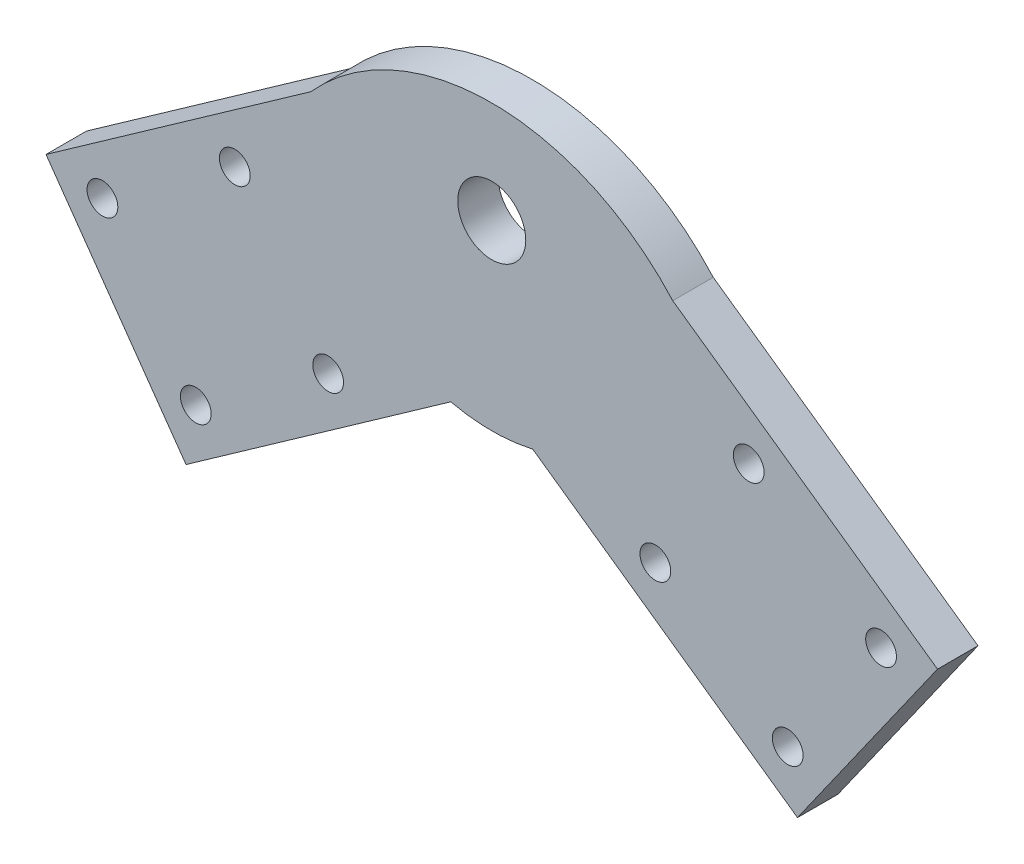
ISO-10303-21;
HEADER;
FILE_DESCRIPTION(('STEP AP214'),'2;1');
FILE_NAME('part.step','',(''),(''),'','','');
FILE_SCHEMA(('AUTOMOTIVE_DESIGN { 1 0 10303 214 1 1 1 1 }'));
ENDSEC;
DATA;
#1=APPLICATION_CONTEXT('core data for automotive mechanical design processes');
#2=APPLICATION_PROTOCOL_DEFINITION('international standard','automotive_design',2000,#1);
#3=PRODUCT_CONTEXT('',#1,'mechanical');
#4=PRODUCT('Part','Part','',(#3));
#5=PRODUCT_RELATED_PRODUCT_CATEGORY('part','',(#4));
#6=PRODUCT_DEFINITION_FORMATION('','',#4);
#7=PRODUCT_DEFINITION_CONTEXT('part definition',#1,'design');
#8=PRODUCT_DEFINITION('design','',#6,#7);
#9=PRODUCT_DEFINITION_SHAPE('','',#8);
#10=(LENGTH_UNIT() NAMED_UNIT(*) SI_UNIT(.MILLI.,.METRE.));
#11=(NAMED_UNIT(*) PLANE_ANGLE_UNIT() SI_UNIT($,.RADIAN.));
#12=(NAMED_UNIT(*) SI_UNIT($,.STERADIAN.) SOLID_ANGLE_UNIT());
#13=UNCERTAINTY_MEASURE_WITH_UNIT(LENGTH_MEASURE(1.E-05),#10,'distance_accuracy_value','');
#14=(GEOMETRIC_REPRESENTATION_CONTEXT(3) GLOBAL_UNCERTAINTY_ASSIGNED_CONTEXT((#13)) GLOBAL_UNIT_ASSIGNED_CONTEXT((#10,
#11,#12)) REPRESENTATION_CONTEXT('',''));
#15=CARTESIAN_POINT('',(0.,0.,0.));
#16=DIRECTION('',(0.,0.,1.));
#17=DIRECTION('',(1.,0.,0.));
#18=AXIS2_PLACEMENT_3D('',#15,#16,#17);
#19=CARTESIAN_POINT('',(0.,-17.4178512732149,5.));
#20=DIRECTION('',(0.,0.,-1.));
#21=DIRECTION('',(-1.,0.,0.));
#22=AXIS2_PLACEMENT_3D('',#19,#20,#21);
#23=CYLINDRICAL_SURFACE('',#22,30.);
#24=CARTESIAN_POINT('',(0.,-17.4178512732149,0.));
#25=DIRECTION('',(0.,0.,1.));
#26=DIRECTION('',(1.,0.,0.));
#27=AXIS2_PLACEMENT_3D('',#24,#25,#26);
#28=CIRCLE('',#27,30.);
#29=CARTESIAN_POINT('',(-22.3499546368663,2.59413332926824,0.));
#30=VERTEX_POINT('',#29);
#31=CARTESIAN_POINT('',(22.3499546368663,2.59413332926824,0.));
#32=VERTEX_POINT('',#31);
#33=EDGE_CURVE('E144',#30,#32,#28,.F.);
#34=ORIENTED_EDGE('',*,*,#33,.F.);
#35=DIRECTION('',(0.,0.,-1.));
#36=VECTOR('',#35,1.);
#37=CARTESIAN_POINT('',(-22.3499546368663,2.59413332926824,5.));
#38=LINE('',#37,#36);
#39=CARTESIAN_POINT('',(-22.3499546368663,2.59413332926824,5.));
#40=VERTEX_POINT('',#39);
#41=EDGE_CURVE('E11',#40,#30,#38,.T.);
#42=ORIENTED_EDGE('',*,*,#41,.F.);
#43=CARTESIAN_POINT('',(0.,-17.4178512732149,5.));
#44=DIRECTION('',(0.,0.,1.));
#45=DIRECTION('',(1.,0.,0.));
#46=AXIS2_PLACEMENT_3D('',#43,#44,#45);
#47=CIRCLE('',#46,30.);
#48=CARTESIAN_POINT('',(22.3499546368663,2.59413332926824,5.));
#49=VERTEX_POINT('',#48);
#50=EDGE_CURVE('E167',#40,#49,#47,.F.);
#51=ORIENTED_EDGE('',*,*,#50,.T.);
#52=DIRECTION('',(0.,0.,-1.));
#53=VECTOR('',#52,1.);
#54=CARTESIAN_POINT('',(22.3499546368663,2.59413332926824,5.));
#55=LINE('',#54,#53);
#56=EDGE_CURVE('E61',#49,#32,#55,.T.);
#57=ORIENTED_EDGE('',*,*,#56,.T.);
#58=EDGE_LOOP('',(#34,#42,#51,#57));
#59=FACE_BOUND('',#58,.T.);
#60=ADVANCED_FACE('F45',(#59),#23,.T.);
#61=CARTESIAN_POINT('',(-8.64427795706465,12.258729893468,5.));
#62=DIRECTION('',(0.576285197137643,-0.817248659564534,0.));
#63=DIRECTION('',(0.817248659564534,0.576285197137643,0.));
#64=AXIS2_PLACEMENT_3D('',#61,#62,#63);
#65=PLANE('',#64);
#66=DIRECTION('',(-0.817248659564534,-0.576285197137643,0.));
#67=VECTOR('',#66,1.);
#68=CARTESIAN_POINT('',(-8.64427795706465,12.258729893468,0.));
#69=LINE('',#68,#67);
#70=CARTESIAN_POINT('',(-55.0399010194476,-20.4572745562375,0.));
#71=VERTEX_POINT('',#70);
#72=EDGE_CURVE('E146',#30,#71,#69,.T.);
#73=ORIENTED_EDGE('',*,*,#72,.T.);
#74=DIRECTION('',(0.,0.,-1.));
#75=VECTOR('',#74,1.);
#76=CARTESIAN_POINT('',(-55.0399010194476,-20.4572745562375,5.));
#77=LINE('',#76,#75);
#78=CARTESIAN_POINT('',(-55.0399010194476,-20.4572745562375,5.));
#79=VERTEX_POINT('',#78);
#80=EDGE_CURVE('E53',#79,#71,#77,.T.);
#81=ORIENTED_EDGE('',*,*,#80,.F.);
#82=DIRECTION('',(-0.817248659564534,-0.576285197137643,0.));
#83=VECTOR('',#82,1.);
#84=CARTESIAN_POINT('',(-8.64427795706465,12.258729893468,5.));
#85=LINE('',#84,#83);
#86=EDGE_CURVE('E193',#40,#79,#85,.T.);
#87=ORIENTED_EDGE('',*,*,#86,.F.);
#88=ORIENTED_EDGE('',*,*,#41,.T.);
#89=EDGE_LOOP('',(#73,#81,#87,#88));
#90=FACE_BOUND('',#89,.T.);
#91=ADVANCED_FACE('F183',(#90),#65,.F.);
#92=CARTESIAN_POINT('',(-46.395623062383,-32.7160044497055,5.));
#93=DIRECTION('',(-0.817248659564534,-0.576285197137643,0.));
#94=DIRECTION('',(0.576285197137643,-0.817248659564534,0.));
#95=AXIS2_PLACEMENT_3D('',#92,#93,#94);
#96=PLANE('',#95);
#97=DIRECTION('',(-0.576285197137643,0.817248659564534,0.));
#98=VECTOR('',#97,1.);
#99=CARTESIAN_POINT('',(-46.395623062383,-32.7160044497055,0.));
#100=LINE('',#99,#98);
#101=CARTESIAN_POINT('',(-37.7513451053183,-44.9747343431735,0.));
#102=VERTEX_POINT('',#101);
#103=EDGE_CURVE('E150',#102,#71,#100,.T.);
#104=ORIENTED_EDGE('',*,*,#103,.F.);
#105=DIRECTION('',(0.,0.,-1.));
#106=VECTOR('',#105,1.);
#107=CARTESIAN_POINT('',(-37.7513451053183,-44.9747343431735,5.));
#108=LINE('',#107,#106);
#109=CARTESIAN_POINT('',(-37.7513451053183,-44.9747343431735,5.));
#110=VERTEX_POINT('',#109);
#111=EDGE_CURVE('E173',#110,#102,#108,.T.);
#112=ORIENTED_EDGE('',*,*,#111,.F.);
#113=DIRECTION('',(-0.576285197137643,0.817248659564534,0.));
#114=VECTOR('',#113,1.);
#115=CARTESIAN_POINT('',(-46.395623062383,-32.7160044497055,5.));
#116=LINE('',#115,#114);
#117=EDGE_CURVE('E180',#110,#79,#116,.T.);
#118=ORIENTED_EDGE('',*,*,#117,.T.);
#119=ORIENTED_EDGE('',*,*,#80,.T.);
#120=EDGE_LOOP('',(#104,#112,#118,#119));
#121=FACE_BOUND('',#120,.T.);
#122=ADVANCED_FACE('F178',(#121),#96,.T.);
#123=CARTESIAN_POINT('',(8.64427795706465,-12.258729893468,5.));
#124=DIRECTION('',(0.576285197137643,-0.817248659564534,0.));
#125=DIRECTION('',(0.817248659564534,0.576285197137643,0.));
#126=AXIS2_PLACEMENT_3D('',#123,#124,#125);
#127=PLANE('',#126);
#128=DIRECTION('',(-0.817248659564534,-0.576285197137643,0.));
#129=VECTOR('',#128,1.);
#130=CARTESIAN_POINT('',(8.64427795706465,-12.258729893468,0.));
#131=LINE('',#130,#129);
#132=CARTESIAN_POINT('',(-5.06139872273697,-21.9233264576678,0.));
#133=VERTEX_POINT('',#132);
#134=EDGE_CURVE('E153',#133,#102,#131,.T.);
#135=ORIENTED_EDGE('',*,*,#134,.F.);
#136=DIRECTION('',(0.,0.,-1.));
#137=VECTOR('',#136,1.);
#138=CARTESIAN_POINT('',(-5.06139872273697,-21.9233264576678,5.));
#139=LINE('',#138,#137);
#140=CARTESIAN_POINT('',(-5.06139872273697,-21.9233264576678,5.));
#141=VERTEX_POINT('',#140);
#142=EDGE_CURVE('E171',#141,#133,#139,.T.);
#143=ORIENTED_EDGE('',*,*,#142,.F.);
#144=DIRECTION('',(-0.817248659564534,-0.576285197137643,0.));
#145=VECTOR('',#144,1.);
#146=CARTESIAN_POINT('',(8.64427795706465,-12.258729893468,5.));
#147=LINE('',#146,#145);
#148=EDGE_CURVE('E192',#141,#110,#147,.T.);
#149=ORIENTED_EDGE('',*,*,#148,.T.);
#150=ORIENTED_EDGE('',*,*,#111,.T.);
#151=EDGE_LOOP('',(#135,#143,#149,#150));
#152=FACE_BOUND('',#151,.T.);
#153=ADVANCED_FACE('F190',(#152),#127,.T.);
#154=CARTESIAN_POINT('',(0.,0.,5.));
#155=DIRECTION('',(0.,0.,-1.));
#156=DIRECTION('',(-1.,0.,0.));
#157=AXIS2_PLACEMENT_3D('',#154,#155,#156);
#158=CYLINDRICAL_SURFACE('',#157,22.5);
#159=CARTESIAN_POINT('',(0.,0.,0.));
#160=DIRECTION('',(0.,0.,1.));
#161=DIRECTION('',(1.,0.,0.));
#162=AXIS2_PLACEMENT_3D('',#159,#160,#161);
#163=CIRCLE('',#162,22.5);
#164=CARTESIAN_POINT('',(5.06139872273697,-21.9233264576678,0.));
#165=VERTEX_POINT('',#164);
#166=EDGE_CURVE('E156',#133,#165,#163,.T.);
#167=ORIENTED_EDGE('',*,*,#166,.T.);
#168=DIRECTION('',(0.,0.,-1.));
#169=VECTOR('',#168,1.);
#170=CARTESIAN_POINT('',(5.06139872273697,-21.9233264576678,5.));
#171=LINE('',#170,#169);
#172=CARTESIAN_POINT('',(5.06139872273697,-21.9233264576678,5.));
#173=VERTEX_POINT('',#172);
#174=EDGE_CURVE('E133',#173,#165,#171,.T.);
#175=ORIENTED_EDGE('',*,*,#174,.F.);
#176=CARTESIAN_POINT('',(0.,0.,5.));
#177=DIRECTION('',(0.,0.,1.));
#178=DIRECTION('',(1.,0.,0.));
#179=AXIS2_PLACEMENT_3D('',#176,#177,#178);
#180=CIRCLE('',#179,22.5);
#181=EDGE_CURVE('E121',#141,#173,#180,.T.);
#182=ORIENTED_EDGE('',*,*,#181,.F.);
#183=ORIENTED_EDGE('',*,*,#142,.T.);
#184=EDGE_LOOP('',(#167,#175,#182,#183));
#185=FACE_BOUND('',#184,.T.);
#186=ADVANCED_FACE('F299',(#185),#158,.T.);
#187=CARTESIAN_POINT('',(-8.64427795706464,-12.258729893468,5.));
#188=DIRECTION('',(0.576285197137643,0.817248659564534,0.));
#189=DIRECTION('',(-0.817248659564534,0.576285197137643,0.));
#190=AXIS2_PLACEMENT_3D('',#187,#188,#189);
#191=PLANE('',#190);
#192=DIRECTION('',(0.817248659564534,-0.576285197137643,0.));
#193=VECTOR('',#192,1.);
#194=CARTESIAN_POINT('',(-8.64427795706464,-12.258729893468,0.));
#195=LINE('',#194,#193);
#196=CARTESIAN_POINT('',(37.7513451053184,-44.9747343431735,0.));
#197=VERTEX_POINT('',#196);
#198=EDGE_CURVE('E130',#165,#197,#195,.T.);
#199=ORIENTED_EDGE('',*,*,#198,.T.);
#200=DIRECTION('',(0.,0.,-1.));
#201=VECTOR('',#200,1.);
#202=CARTESIAN_POINT('',(37.7513451053184,-44.9747343431735,5.));
#203=LINE('',#202,#201);
#204=CARTESIAN_POINT('',(37.7513451053184,-44.9747343431735,5.));
#205=VERTEX_POINT('',#204);
#206=EDGE_CURVE('E127',#205,#197,#203,.T.);
#207=ORIENTED_EDGE('',*,*,#206,.F.);
#208=DIRECTION('',(0.817248659564534,-0.576285197137643,0.));
#209=VECTOR('',#208,1.);
#210=CARTESIAN_POINT('',(-8.64427795706464,-12.258729893468,5.));
#211=LINE('',#210,#209);
#212=EDGE_CURVE('E111',#173,#205,#211,.T.);
#213=ORIENTED_EDGE('',*,*,#212,.F.);
#214=ORIENTED_EDGE('',*,*,#174,.T.);
#215=EDGE_LOOP('',(#199,#207,#213,#214));
#216=FACE_BOUND('',#215,.T.);
#217=ADVANCED_FACE('F128',(#216),#191,.F.);
#218=CARTESIAN_POINT('',(46.395623062383,-32.7160044497055,5.));
#219=DIRECTION('',(-0.817248659564535,0.576285197137643,0.));
#220=DIRECTION('',(-0.576285197137643,-0.817248659564535,0.));
#221=AXIS2_PLACEMENT_3D('',#218,#219,#220);
#222=PLANE('',#221);
#223=DIRECTION('',(0.576285197137643,0.817248659564535,0.));
#224=VECTOR('',#223,1.);
#225=CARTESIAN_POINT('',(46.395623062383,-32.7160044497055,0.));
#226=LINE('',#225,#224);
#227=CARTESIAN_POINT('',(55.0399010194476,-20.4572745562375,0.));
#228=VERTEX_POINT('',#227);
#229=EDGE_CURVE('E159',#197,#228,#226,.T.);
#230=ORIENTED_EDGE('',*,*,#229,.T.);
#231=DIRECTION('',(0.,0.,-1.));
#232=VECTOR('',#231,1.);
#233=CARTESIAN_POINT('',(55.0399010194476,-20.4572745562375,5.));
#234=LINE('',#233,#232);
#235=CARTESIAN_POINT('',(55.0399010194476,-20.4572745562375,5.));
#236=VERTEX_POINT('',#235);
#237=EDGE_CURVE('E87',#236,#228,#234,.T.);
#238=ORIENTED_EDGE('',*,*,#237,.F.);
#239=DIRECTION('',(0.576285197137643,0.817248659564535,0.));
#240=VECTOR('',#239,1.);
#241=CARTESIAN_POINT('',(46.395623062383,-32.7160044497055,5.));
#242=LINE('',#241,#240);
#243=EDGE_CURVE('E118',#205,#236,#242,.T.);
#244=ORIENTED_EDGE('',*,*,#243,.F.);
#245=ORIENTED_EDGE('',*,*,#206,.T.);
#246=EDGE_LOOP('',(#230,#238,#244,#245));
#247=FACE_BOUND('',#246,.T.);
#248=ADVANCED_FACE('F135',(#247),#222,.F.);
#249=CARTESIAN_POINT('',(8.64427795706464,12.258729893468,5.));
#250=DIRECTION('',(0.576285197137643,0.817248659564534,0.));
#251=DIRECTION('',(-0.817248659564534,0.576285197137643,0.));
#252=AXIS2_PLACEMENT_3D('',#249,#250,#251);
#253=PLANE('',#252);
#254=DIRECTION('',(0.817248659564534,-0.576285197137643,0.));
#255=VECTOR('',#254,1.);
#256=CARTESIAN_POINT('',(8.64427795706464,12.258729893468,0.));
#257=LINE('',#256,#255);
#258=EDGE_CURVE('E161',#32,#228,#257,.T.);
#259=ORIENTED_EDGE('',*,*,#258,.F.);
#260=ORIENTED_EDGE('',*,*,#56,.F.);
#261=DIRECTION('',(0.817248659564534,-0.576285197137643,0.));
#262=VECTOR('',#261,1.);
#263=CARTESIAN_POINT('',(8.64427795706464,12.258729893468,5.));
#264=LINE('',#263,#262);
#265=EDGE_CURVE('E136',#49,#236,#264,.T.);
#266=ORIENTED_EDGE('',*,*,#265,.T.);
#267=ORIENTED_EDGE('',*,*,#237,.T.);
#268=EDGE_LOOP('',(#259,#260,#266,#267));
#269=FACE_BOUND('',#268,.T.);
#270=ADVANCED_FACE('F286',(#269),#253,.T.);
#271=CARTESIAN_POINT('',(0.,0.,5.));
#272=DIRECTION('',(0.,0.,-1.));
#273=DIRECTION('',(-1.,0.,0.));
#274=AXIS2_PLACEMENT_3D('',#271,#272,#273);
#275=CYLINDRICAL_SURFACE('',#274,4.2);
#276=CARTESIAN_POINT('',(0.,0.,5.));
#277=DIRECTION('',(0.,0.,1.));
#278=DIRECTION('',(1.,0.,0.));
#279=AXIS2_PLACEMENT_3D('',#276,#277,#278);
#280=CIRCLE('',#279,4.2);
#281=CARTESIAN_POINT('',(4.2,0.,5.));
#282=VERTEX_POINT('',#281);
#283=EDGE_CURVE('E138',#282,#282,#280,.T.);
#284=ORIENTED_EDGE('',*,*,#283,.T.);
#285=EDGE_LOOP('',(#284));
#286=FACE_BOUND('',#285,.T.);
#287=CARTESIAN_POINT('',(0.,0.,0.));
#288=DIRECTION('',(0.,0.,1.));
#289=DIRECTION('',(1.,0.,0.));
#290=AXIS2_PLACEMENT_3D('',#287,#288,#289);
#291=CIRCLE('',#290,4.2);
#292=CARTESIAN_POINT('',(4.2,0.,0.));
#293=VERTEX_POINT('',#292);
#294=EDGE_CURVE('E164',#293,#293,#291,.T.);
#295=ORIENTED_EDGE('',*,*,#294,.F.);
#296=EDGE_LOOP('',(#295));
#297=FACE_BOUND('',#296,.T.);
#298=ADVANCED_FACE('F251',(#286,#297),#275,.F.);
#299=CARTESIAN_POINT('',(0.,0.,5.));
#300=DIRECTION('',(0.,0.,1.));
#301=DIRECTION('',(1.,0.,0.));
#302=AXIS2_PLACEMENT_3D('',#299,#300,#301);
#303=PLANE('',#302);
#304=CARTESIAN_POINT('',(-31.7272585446461,-10.1363879256191,5.));
#305=DIRECTION('',(0.,0.,1.));
#306=DIRECTION('',(1.,0.,0.));
#307=AXIS2_PLACEMENT_3D('',#304,#305,#306);
#308=CIRCLE('',#307,1.9);
#309=CARTESIAN_POINT('',(-29.8272585446461,-10.1363879256191,5.));
#310=VERTEX_POINT('',#309);
#311=EDGE_CURVE('E243',#310,#310,#308,.T.);
#312=ORIENTED_EDGE('',*,*,#311,.F.);
#313=EDGE_LOOP('',(#312));
#314=FACE_BOUND('',#313,.T.);
#315=CARTESIAN_POINT('',(-20.2015546018932,-26.4813611169098,5.));
#316=DIRECTION('',(0.,0.,1.));
#317=DIRECTION('',(1.,0.,0.));
#318=AXIS2_PLACEMENT_3D('',#315,#316,#317);
#319=CIRCLE('',#318,1.9);
#320=CARTESIAN_POINT('',(-18.3015546018932,-26.4813611169098,5.));
#321=VERTEX_POINT('',#320);
#322=EDGE_CURVE('E237',#321,#321,#319,.T.);
#323=ORIENTED_EDGE('',*,*,#322,.F.);
#324=EDGE_LOOP('',(#323));
#325=FACE_BOUND('',#324,.T.);
#326=CARTESIAN_POINT('',(-36.5465277931839,-38.0070650596626,5.));
#327=DIRECTION('',(0.,0.,1.));
#328=DIRECTION('',(1.,0.,0.));
#329=AXIS2_PLACEMENT_3D('',#326,#327,#328);
#330=CIRCLE('',#329,1.9);
#331=CARTESIAN_POINT('',(-34.6465277931839,-38.0070650596626,5.));
#332=VERTEX_POINT('',#331);
#333=EDGE_CURVE('E231',#332,#332,#330,.T.);
#334=ORIENTED_EDGE('',*,*,#333,.F.);
#335=EDGE_LOOP('',(#334));
#336=FACE_BOUND('',#335,.T.);
#337=CARTESIAN_POINT('',(-48.0722317359367,-21.6620918683719,5.));
#338=DIRECTION('',(0.,0.,1.));
#339=DIRECTION('',(1.,0.,0.));
#340=AXIS2_PLACEMENT_3D('',#337,#338,#339);
#341=CIRCLE('',#340,1.9);
#342=CARTESIAN_POINT('',(-46.1722317359367,-21.6620918683719,5.));
#343=VERTEX_POINT('',#342);
#344=EDGE_CURVE('E225',#343,#343,#341,.T.);
#345=ORIENTED_EDGE('',*,*,#344,.F.);
#346=EDGE_LOOP('',(#345));
#347=FACE_BOUND('',#346,.T.);
#348=CARTESIAN_POINT('',(31.7272585446461,-10.1363879256191,5.));
#349=DIRECTION('',(0.,0.,1.));
#350=DIRECTION('',(1.,0.,0.));
#351=AXIS2_PLACEMENT_3D('',#348,#349,#350);
#352=CIRCLE('',#351,1.9);
#353=CARTESIAN_POINT('',(33.6272585446461,-10.1363879256191,5.));
#354=VERTEX_POINT('',#353);
#355=EDGE_CURVE('E219',#354,#354,#352,.T.);
#356=ORIENTED_EDGE('',*,*,#355,.F.);
#357=EDGE_LOOP('',(#356));
#358=FACE_BOUND('',#357,.T.);
#359=CARTESIAN_POINT('',(48.0722317359367,-21.6620918683719,5.));
#360=DIRECTION('',(0.,0.,1.));
#361=DIRECTION('',(1.,0.,0.));
#362=AXIS2_PLACEMENT_3D('',#359,#360,#361);
#363=CIRCLE('',#362,1.9);
#364=CARTESIAN_POINT('',(49.9722317359367,-21.6620918683719,5.));
#365=VERTEX_POINT('',#364);
#366=EDGE_CURVE('E213',#365,#365,#363,.T.);
#367=ORIENTED_EDGE('',*,*,#366,.F.);
#368=EDGE_LOOP('',(#367));
#369=FACE_BOUND('',#368,.T.);
#370=CARTESIAN_POINT('',(20.201554544252,-26.4813611986526,5.));
#371=DIRECTION('',(0.,0.,1.));
#372=DIRECTION('',(1.,0.,0.));
#373=AXIS2_PLACEMENT_3D('',#370,#371,#372);
#374=CIRCLE('',#373,1.9);
#375=CARTESIAN_POINT('',(22.101554544252,-26.4813611986526,5.));
#376=VERTEX_POINT('',#375);
#377=EDGE_CURVE('E207',#376,#376,#374,.T.);
#378=ORIENTED_EDGE('',*,*,#377,.F.);
#379=EDGE_LOOP('',(#378));
#380=FACE_BOUND('',#379,.T.);
#381=CARTESIAN_POINT('',(36.5465277355427,-38.0070651414055,5.));
#382=DIRECTION('',(0.,0.,1.));
#383=DIRECTION('',(1.,0.,0.));
#384=AXIS2_PLACEMENT_3D('',#381,#382,#383);
#385=CIRCLE('',#384,1.9);
#386=CARTESIAN_POINT('',(38.4465277355427,-38.0070651414055,5.));
#387=VERTEX_POINT('',#386);
#388=EDGE_CURVE('E201',#387,#387,#385,.T.);
#389=ORIENTED_EDGE('',*,*,#388,.F.);
#390=EDGE_LOOP('',(#389));
#391=FACE_BOUND('',#390,.T.);
#392=ORIENTED_EDGE('',*,*,#50,.F.);
#393=ORIENTED_EDGE('',*,*,#86,.T.);
#394=ORIENTED_EDGE('',*,*,#117,.F.);
#395=ORIENTED_EDGE('',*,*,#148,.F.);
#396=ORIENTED_EDGE('',*,*,#181,.T.);
#397=ORIENTED_EDGE('',*,*,#212,.T.);
#398=ORIENTED_EDGE('',*,*,#243,.T.);
#399=ORIENTED_EDGE('',*,*,#265,.F.);
#400=EDGE_LOOP('',(#392,#393,#394,#395,#396,#397,#398,#399));
#401=FACE_BOUND('',#400,.T.);
#402=ORIENTED_EDGE('',*,*,#283,.F.);
#403=EDGE_LOOP('',(#402));
#404=FACE_BOUND('',#403,.T.);
#405=ADVANCED_FACE('F114',(#314,#325,#336,#347,#358,#369,#380,#391,#401,#404),#303,.T.);
#406=CARTESIAN_POINT('',(0.,0.,0.));
#407=DIRECTION('',(0.,0.,1.));
#408=DIRECTION('',(1.,0.,0.));
#409=AXIS2_PLACEMENT_3D('',#406,#407,#408);
#410=PLANE('',#409);
#411=CARTESIAN_POINT('',(-31.7272585446461,-10.1363879256191,0.));
#412=DIRECTION('',(0.,0.,1.));
#413=DIRECTION('',(1.,0.,0.));
#414=AXIS2_PLACEMENT_3D('',#411,#412,#413);
#415=CIRCLE('',#414,1.9);
#416=CARTESIAN_POINT('',(-29.8272585446461,-10.1363879256191,0.));
#417=VERTEX_POINT('',#416);
#418=EDGE_CURVE('E240',#417,#417,#415,.T.);
#419=ORIENTED_EDGE('',*,*,#418,.T.);
#420=EDGE_LOOP('',(#419));
#421=FACE_BOUND('',#420,.T.);
#422=CARTESIAN_POINT('',(-20.2015546018932,-26.4813611169098,0.));
#423=DIRECTION('',(0.,0.,1.));
#424=DIRECTION('',(1.,0.,0.));
#425=AXIS2_PLACEMENT_3D('',#422,#423,#424);
#426=CIRCLE('',#425,1.9);
#427=CARTESIAN_POINT('',(-18.3015546018932,-26.4813611169098,0.));
#428=VERTEX_POINT('',#427);
#429=EDGE_CURVE('E234',#428,#428,#426,.T.);
#430=ORIENTED_EDGE('',*,*,#429,.T.);
#431=EDGE_LOOP('',(#430));
#432=FACE_BOUND('',#431,.T.);
#433=CARTESIAN_POINT('',(-36.5465277931839,-38.0070650596626,0.));
#434=DIRECTION('',(0.,0.,1.));
#435=DIRECTION('',(1.,0.,0.));
#436=AXIS2_PLACEMENT_3D('',#433,#434,#435);
#437=CIRCLE('',#436,1.9);
#438=CARTESIAN_POINT('',(-34.6465277931839,-38.0070650596626,0.));
#439=VERTEX_POINT('',#438);
#440=EDGE_CURVE('E228',#439,#439,#437,.T.);
#441=ORIENTED_EDGE('',*,*,#440,.T.);
#442=EDGE_LOOP('',(#441));
#443=FACE_BOUND('',#442,.T.);
#444=CARTESIAN_POINT('',(-48.0722317359367,-21.6620918683719,0.));
#445=DIRECTION('',(0.,0.,1.));
#446=DIRECTION('',(1.,0.,0.));
#447=AXIS2_PLACEMENT_3D('',#444,#445,#446);
#448=CIRCLE('',#447,1.9);
#449=CARTESIAN_POINT('',(-46.1722317359367,-21.6620918683719,0.));
#450=VERTEX_POINT('',#449);
#451=EDGE_CURVE('E222',#450,#450,#448,.T.);
#452=ORIENTED_EDGE('',*,*,#451,.T.);
#453=EDGE_LOOP('',(#452));
#454=FACE_BOUND('',#453,.T.);
#455=CARTESIAN_POINT('',(31.7272585446461,-10.1363879256191,0.));
#456=DIRECTION('',(0.,0.,1.));
#457=DIRECTION('',(1.,0.,0.));
#458=AXIS2_PLACEMENT_3D('',#455,#456,#457);
#459=CIRCLE('',#458,1.9);
#460=CARTESIAN_POINT('',(33.6272585446461,-10.1363879256191,0.));
#461=VERTEX_POINT('',#460);
#462=EDGE_CURVE('E216',#461,#461,#459,.T.);
#463=ORIENTED_EDGE('',*,*,#462,.T.);
#464=EDGE_LOOP('',(#463));
#465=FACE_BOUND('',#464,.T.);
#466=CARTESIAN_POINT('',(48.0722317359367,-21.6620918683719,0.));
#467=DIRECTION('',(0.,0.,1.));
#468=DIRECTION('',(1.,0.,0.));
#469=AXIS2_PLACEMENT_3D('',#466,#467,#468);
#470=CIRCLE('',#469,1.9);
#471=CARTESIAN_POINT('',(49.9722317359367,-21.6620918683719,0.));
#472=VERTEX_POINT('',#471);
#473=EDGE_CURVE('E210',#472,#472,#470,.T.);
#474=ORIENTED_EDGE('',*,*,#473,.T.);
#475=EDGE_LOOP('',(#474));
#476=FACE_BOUND('',#475,.T.);
#477=CARTESIAN_POINT('',(20.201554544252,-26.4813611986526,0.));
#478=DIRECTION('',(0.,0.,1.));
#479=DIRECTION('',(1.,0.,0.));
#480=AXIS2_PLACEMENT_3D('',#477,#478,#479);
#481=CIRCLE('',#480,1.9);
#482=CARTESIAN_POINT('',(22.101554544252,-26.4813611986526,0.));
#483=VERTEX_POINT('',#482);
#484=EDGE_CURVE('E204',#483,#483,#481,.T.);
#485=ORIENTED_EDGE('',*,*,#484,.T.);
#486=EDGE_LOOP('',(#485));
#487=FACE_BOUND('',#486,.T.);
#488=CARTESIAN_POINT('',(36.5465277355427,-38.0070651414055,0.));
#489=DIRECTION('',(0.,0.,1.));
#490=DIRECTION('',(1.,0.,0.));
#491=AXIS2_PLACEMENT_3D('',#488,#489,#490);
#492=CIRCLE('',#491,1.9);
#493=CARTESIAN_POINT('',(38.4465277355427,-38.0070651414055,0.));
#494=VERTEX_POINT('',#493);
#495=EDGE_CURVE('E147',#494,#494,#492,.T.);
#496=ORIENTED_EDGE('',*,*,#495,.T.);
#497=EDGE_LOOP('',(#496));
#498=FACE_BOUND('',#497,.T.);
#499=ORIENTED_EDGE('',*,*,#33,.T.);
#500=ORIENTED_EDGE('',*,*,#258,.T.);
#501=ORIENTED_EDGE('',*,*,#229,.F.);
#502=ORIENTED_EDGE('',*,*,#198,.F.);
#503=ORIENTED_EDGE('',*,*,#166,.F.);
#504=ORIENTED_EDGE('',*,*,#134,.T.);
#505=ORIENTED_EDGE('',*,*,#103,.T.);
#506=ORIENTED_EDGE('',*,*,#72,.F.);
#507=EDGE_LOOP('',(#499,#500,#501,#502,#503,#504,#505,#506));
#508=FACE_BOUND('',#507,.T.);
#509=ORIENTED_EDGE('',*,*,#294,.T.);
#510=EDGE_LOOP('',(#509));
#511=FACE_BOUND('',#510,.T.);
#512=ADVANCED_FACE('F185',(#421,#432,#443,#454,#465,#476,#487,#498,#508,#511),#410,.F.);
#513=CARTESIAN_POINT('',(36.5465277355427,-38.0070651414055,5.));
#514=DIRECTION('',(0.,0.,1.));
#515=DIRECTION('',(1.,0.,0.));
#516=AXIS2_PLACEMENT_3D('',#513,#514,#515);
#517=CYLINDRICAL_SURFACE('',#516,1.9);
#518=ORIENTED_EDGE('',*,*,#495,.F.);
#519=EDGE_LOOP('',(#518));
#520=FACE_BOUND('',#519,.T.);
#521=ORIENTED_EDGE('',*,*,#388,.T.);
#522=EDGE_LOOP('',(#521));
#523=FACE_BOUND('',#522,.T.);
#524=ADVANCED_FACE('F267',(#520,#523),#517,.F.);
#525=CARTESIAN_POINT('',(20.201554544252,-26.4813611986526,5.));
#526=DIRECTION('',(0.,0.,1.));
#527=DIRECTION('',(1.,0.,0.));
#528=AXIS2_PLACEMENT_3D('',#525,#526,#527);
#529=CYLINDRICAL_SURFACE('',#528,1.9);
#530=ORIENTED_EDGE('',*,*,#484,.F.);
#531=EDGE_LOOP('',(#530));
#532=FACE_BOUND('',#531,.T.);
#533=ORIENTED_EDGE('',*,*,#377,.T.);
#534=EDGE_LOOP('',(#533));
#535=FACE_BOUND('',#534,.T.);
#536=ADVANCED_FACE('F269',(#532,#535),#529,.F.);
#537=CARTESIAN_POINT('',(48.0722317359367,-21.6620918683719,5.));
#538=DIRECTION('',(0.,0.,1.));
#539=DIRECTION('',(1.,0.,0.));
#540=AXIS2_PLACEMENT_3D('',#537,#538,#539);
#541=CYLINDRICAL_SURFACE('',#540,1.9);
#542=ORIENTED_EDGE('',*,*,#473,.F.);
#543=EDGE_LOOP('',(#542));
#544=FACE_BOUND('',#543,.T.);
#545=ORIENTED_EDGE('',*,*,#366,.T.);
#546=EDGE_LOOP('',(#545));
#547=FACE_BOUND('',#546,.T.);
#548=ADVANCED_FACE('F276',(#544,#547),#541,.F.);
#549=CARTESIAN_POINT('',(31.7272585446461,-10.1363879256191,5.));
#550=DIRECTION('',(0.,0.,1.));
#551=DIRECTION('',(1.,0.,0.));
#552=AXIS2_PLACEMENT_3D('',#549,#550,#551);
#553=CYLINDRICAL_SURFACE('',#552,1.9);
#554=ORIENTED_EDGE('',*,*,#462,.F.);
#555=EDGE_LOOP('',(#554));
#556=FACE_BOUND('',#555,.T.);
#557=ORIENTED_EDGE('',*,*,#355,.T.);
#558=EDGE_LOOP('',(#557));
#559=FACE_BOUND('',#558,.T.);
#560=ADVANCED_FACE('F372',(#556,#559),#553,.F.);
#561=CARTESIAN_POINT('',(-48.0722317359367,-21.6620918683719,5.));
#562=DIRECTION('',(0.,0.,1.));
#563=DIRECTION('',(1.,0.,0.));
#564=AXIS2_PLACEMENT_3D('',#561,#562,#563);
#565=CYLINDRICAL_SURFACE('',#564,1.9);
#566=ORIENTED_EDGE('',*,*,#451,.F.);
#567=EDGE_LOOP('',(#566));
#568=FACE_BOUND('',#567,.T.);
#569=ORIENTED_EDGE('',*,*,#344,.T.);
#570=EDGE_LOOP('',(#569));
#571=FACE_BOUND('',#570,.T.);
#572=ADVANCED_FACE('F382',(#568,#571),#565,.F.);
#573=CARTESIAN_POINT('',(-36.5465277931839,-38.0070650596626,5.));
#574=DIRECTION('',(0.,0.,1.));
#575=DIRECTION('',(1.,0.,0.));
#576=AXIS2_PLACEMENT_3D('',#573,#574,#575);
#577=CYLINDRICAL_SURFACE('',#576,1.9);
#578=ORIENTED_EDGE('',*,*,#440,.F.);
#579=EDGE_LOOP('',(#578));
#580=FACE_BOUND('',#579,.T.);
#581=ORIENTED_EDGE('',*,*,#333,.T.);
#582=EDGE_LOOP('',(#581));
#583=FACE_BOUND('',#582,.T.);
#584=ADVANCED_FACE('F392',(#580,#583),#577,.F.);
#585=CARTESIAN_POINT('',(-20.2015546018932,-26.4813611169098,5.));
#586=DIRECTION('',(0.,0.,1.));
#587=DIRECTION('',(1.,0.,0.));
#588=AXIS2_PLACEMENT_3D('',#585,#586,#587);
#589=CYLINDRICAL_SURFACE('',#588,1.9);
#590=ORIENTED_EDGE('',*,*,#429,.F.);
#591=EDGE_LOOP('',(#590));
#592=FACE_BOUND('',#591,.T.);
#593=ORIENTED_EDGE('',*,*,#322,.T.);
#594=EDGE_LOOP('',(#593));
#595=FACE_BOUND('',#594,.T.);
#596=ADVANCED_FACE('F402',(#592,#595),#589,.F.);
#597=CARTESIAN_POINT('',(-31.7272585446461,-10.1363879256191,5.));
#598=DIRECTION('',(0.,0.,1.));
#599=DIRECTION('',(1.,0.,0.));
#600=AXIS2_PLACEMENT_3D('',#597,#598,#599);
#601=CYLINDRICAL_SURFACE('',#600,1.9);
#602=ORIENTED_EDGE('',*,*,#418,.F.);
#603=EDGE_LOOP('',(#602));
#604=FACE_BOUND('',#603,.T.);
#605=ORIENTED_EDGE('',*,*,#311,.T.);
#606=EDGE_LOOP('',(#605));
#607=FACE_BOUND('',#606,.T.);
#608=ADVANCED_FACE('F247',(#604,#607),#601,.F.);
#609=CLOSED_SHELL('',(#60,#91,#122,#153,#186,#217,#248,#270,#298,#405,#512,#524,#536,#548,#560,
#572,#584,#596,#608));
#610=MANIFOLD_SOLID_BREP('B2',#609);
#611=ADVANCED_BREP_SHAPE_REPRESENTATION('',(#18,#610),#14);
#612=SHAPE_DEFINITION_REPRESENTATION(#9,#611);
ENDSEC;
END-ISO-10303-21;
